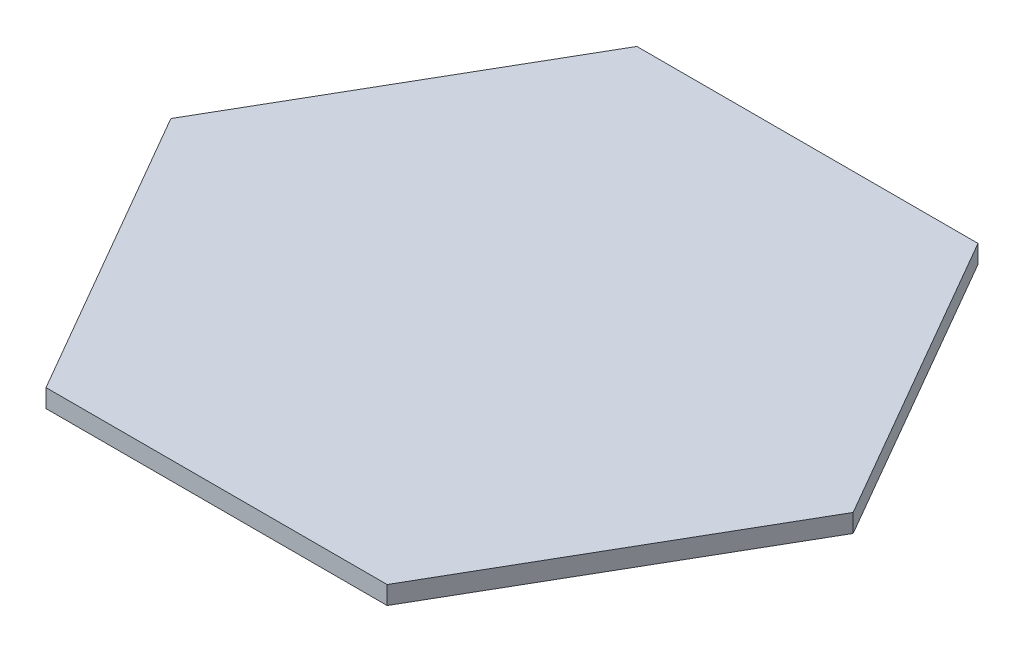
ISO-10303-21;
HEADER;
FILE_DESCRIPTION(('STEP AP214'),'2;1');
FILE_NAME('part.step','',(''),(''),'','','');
FILE_SCHEMA(('AUTOMOTIVE_DESIGN { 1 0 10303 214 1 1 1 1 }'));
ENDSEC;
DATA;
#1=APPLICATION_CONTEXT('core data for automotive mechanical design processes');
#2=APPLICATION_PROTOCOL_DEFINITION('international standard','automotive_design',2000,#1);
#3=PRODUCT_CONTEXT('',#1,'mechanical');
#4=PRODUCT('Part','Part','',(#3));
#5=PRODUCT_RELATED_PRODUCT_CATEGORY('part','',(#4));
#6=PRODUCT_DEFINITION_FORMATION('','',#4);
#7=PRODUCT_DEFINITION_CONTEXT('part definition',#1,'design');
#8=PRODUCT_DEFINITION('design','',#6,#7);
#9=PRODUCT_DEFINITION_SHAPE('','',#8);
#10=(LENGTH_UNIT() NAMED_UNIT(*) SI_UNIT(.MILLI.,.METRE.));
#11=(NAMED_UNIT(*) PLANE_ANGLE_UNIT() SI_UNIT($,.RADIAN.));
#12=(NAMED_UNIT(*) SI_UNIT($,.STERADIAN.) SOLID_ANGLE_UNIT());
#13=UNCERTAINTY_MEASURE_WITH_UNIT(LENGTH_MEASURE(1.E-05),#10,'distance_accuracy_value','');
#14=(GEOMETRIC_REPRESENTATION_CONTEXT(3) GLOBAL_UNCERTAINTY_ASSIGNED_CONTEXT((#13)) GLOBAL_UNIT_ASSIGNED_CONTEXT((#10,
#11,#12)) REPRESENTATION_CONTEXT('',''));
#15=CARTESIAN_POINT('',(0.,0.,0.));
#16=DIRECTION('',(0.,0.,1.));
#17=DIRECTION('',(1.,0.,0.));
#18=AXIS2_PLACEMENT_3D('',#15,#16,#17);
#19=CARTESIAN_POINT('',(29.7198384506252,3.175,51.4762701892219));
#20=DIRECTION('',(-0.866025403784439,0.,-0.499999999999999));
#21=DIRECTION('',(-0.5,0.,0.866025403784439));
#22=AXIS2_PLACEMENT_3D('',#19,#20,#21);
#23=PLANE('',#22);
#24=DIRECTION('',(0.499999999999999,0.,-0.866025403784439));
#25=VECTOR('',#24,1.);
#26=CARTESIAN_POINT('',(29.7198384506252,0.,51.4762701892219));
#27=LINE('',#26,#25);
#28=CARTESIAN_POINT('',(29.7198384506252,0.,51.4762701892219));
#29=VERTEX_POINT('',#28);
#30=CARTESIAN_POINT('',(59.4396769012504,0.,0.));
#31=VERTEX_POINT('',#30);
#32=EDGE_CURVE('E116',#29,#31,#27,.T.);
#33=ORIENTED_EDGE('',*,*,#32,.T.);
#34=DIRECTION('',(0.,-1.,0.));
#35=VECTOR('',#34,1.);
#36=CARTESIAN_POINT('',(59.4396769012504,3.175,0.));
#37=LINE('',#36,#35);
#38=CARTESIAN_POINT('',(59.4396769012504,3.175,0.));
#39=VERTEX_POINT('',#38);
#40=EDGE_CURVE('E11',#39,#31,#37,.T.);
#41=ORIENTED_EDGE('',*,*,#40,.F.);
#42=DIRECTION('',(0.499999999999999,0.,-0.866025403784439));
#43=VECTOR('',#42,1.);
#44=CARTESIAN_POINT('',(29.7198384506252,3.175,51.4762701892219));
#45=LINE('',#44,#43);
#46=CARTESIAN_POINT('',(29.7198384506252,3.175,51.4762701892219));
#47=VERTEX_POINT('',#46);
#48=EDGE_CURVE('E126',#47,#39,#45,.T.);
#49=ORIENTED_EDGE('',*,*,#48,.F.);
#50=DIRECTION('',(0.,-1.,0.));
#51=VECTOR('',#50,1.);
#52=CARTESIAN_POINT('',(29.7198384506252,3.175,51.4762701892219));
#53=LINE('',#52,#51);
#54=EDGE_CURVE('E112',#47,#29,#53,.T.);
#55=ORIENTED_EDGE('',*,*,#54,.T.);
#56=EDGE_LOOP('',(#33,#41,#49,#55));
#57=FACE_BOUND('',#56,.T.);
#58=ADVANCED_FACE('F32',(#57),#23,.F.);
#59=CARTESIAN_POINT('',(59.4396769012504,3.175,0.));
#60=DIRECTION('',(-0.866025403784438,0.,0.5));
#61=DIRECTION('',(0.5,0.,0.866025403784438));
#62=AXIS2_PLACEMENT_3D('',#59,#60,#61);
#63=PLANE('',#62);
#64=DIRECTION('',(-0.5,0.,-0.866025403784438));
#65=VECTOR('',#64,1.);
#66=CARTESIAN_POINT('',(59.4396769012504,0.,0.));
#67=LINE('',#66,#65);
#68=CARTESIAN_POINT('',(29.7198384506252,0.,-51.4762701892219));
#69=VERTEX_POINT('',#68);
#70=EDGE_CURVE('E119',#31,#69,#67,.T.);
#71=ORIENTED_EDGE('',*,*,#70,.T.);
#72=DIRECTION('',(0.,-1.,0.));
#73=VECTOR('',#72,1.);
#74=CARTESIAN_POINT('',(29.7198384506252,3.175,-51.4762701892219));
#75=LINE('',#74,#73);
#76=CARTESIAN_POINT('',(29.7198384506252,3.175,-51.4762701892219));
#77=VERTEX_POINT('',#76);
#78=EDGE_CURVE('E40',#77,#69,#75,.T.);
#79=ORIENTED_EDGE('',*,*,#78,.F.);
#80=DIRECTION('',(-0.5,0.,-0.866025403784438));
#81=VECTOR('',#80,1.);
#82=CARTESIAN_POINT('',(59.4396769012504,3.175,0.));
#83=LINE('',#82,#81);
#84=EDGE_CURVE('E85',#39,#77,#83,.T.);
#85=ORIENTED_EDGE('',*,*,#84,.F.);
#86=ORIENTED_EDGE('',*,*,#40,.T.);
#87=EDGE_LOOP('',(#71,#79,#85,#86));
#88=FACE_BOUND('',#87,.T.);
#89=ADVANCED_FACE('F150',(#88),#63,.F.);
#90=CARTESIAN_POINT('',(29.7198384506252,3.175,-51.4762701892219));
#91=DIRECTION('',(0.,0.,1.));
#92=DIRECTION('',(1.,0.,0.));
#93=AXIS2_PLACEMENT_3D('',#90,#91,#92);
#94=PLANE('',#93);
#95=DIRECTION('',(-1.,0.,0.));
#96=VECTOR('',#95,1.);
#97=CARTESIAN_POINT('',(29.7198384506252,0.,-51.4762701892219));
#98=LINE('',#97,#96);
#99=CARTESIAN_POINT('',(-29.7198384506252,0.,-51.4762701892219));
#100=VERTEX_POINT('',#99);
#101=EDGE_CURVE('E121',#69,#100,#98,.T.);
#102=ORIENTED_EDGE('',*,*,#101,.T.);
#103=DIRECTION('',(0.,-1.,0.));
#104=VECTOR('',#103,1.);
#105=CARTESIAN_POINT('',(-29.7198384506252,3.175,-51.4762701892219));
#106=LINE('',#105,#104);
#107=CARTESIAN_POINT('',(-29.7198384506252,3.175,-51.4762701892219));
#108=VERTEX_POINT('',#107);
#109=EDGE_CURVE('E107',#108,#100,#106,.T.);
#110=ORIENTED_EDGE('',*,*,#109,.F.);
#111=DIRECTION('',(-1.,0.,0.));
#112=VECTOR('',#111,1.);
#113=CARTESIAN_POINT('',(29.7198384506252,3.175,-51.4762701892219));
#114=LINE('',#113,#112);
#115=EDGE_CURVE('E98',#77,#108,#114,.T.);
#116=ORIENTED_EDGE('',*,*,#115,.F.);
#117=ORIENTED_EDGE('',*,*,#78,.T.);
#118=EDGE_LOOP('',(#102,#110,#116,#117));
#119=FACE_BOUND('',#118,.T.);
#120=ADVANCED_FACE('F132',(#119),#94,.F.);
#121=CARTESIAN_POINT('',(-29.7198384506252,3.175,-51.4762701892219));
#122=DIRECTION('',(0.866025403784439,0.,0.5));
#123=DIRECTION('',(0.5,0.,-0.866025403784439));
#124=AXIS2_PLACEMENT_3D('',#121,#122,#123);
#125=PLANE('',#124);
#126=DIRECTION('',(-0.5,0.,0.866025403784439));
#127=VECTOR('',#126,1.);
#128=CARTESIAN_POINT('',(-29.7198384506252,0.,-51.4762701892219));
#129=LINE('',#128,#127);
#130=CARTESIAN_POINT('',(-59.4396769012504,0.,0.));
#131=VERTEX_POINT('',#130);
#132=EDGE_CURVE('E106',#100,#131,#129,.T.);
#133=ORIENTED_EDGE('',*,*,#132,.T.);
#134=DIRECTION('',(0.,-1.,0.));
#135=VECTOR('',#134,1.);
#136=CARTESIAN_POINT('',(-59.4396769012504,3.175,0.));
#137=LINE('',#136,#135);
#138=CARTESIAN_POINT('',(-59.4396769012504,3.175,0.));
#139=VERTEX_POINT('',#138);
#140=EDGE_CURVE('E103',#139,#131,#137,.T.);
#141=ORIENTED_EDGE('',*,*,#140,.F.);
#142=DIRECTION('',(-0.5,0.,0.866025403784439));
#143=VECTOR('',#142,1.);
#144=CARTESIAN_POINT('',(-29.7198384506252,3.175,-51.4762701892219));
#145=LINE('',#144,#143);
#146=EDGE_CURVE('E92',#108,#139,#145,.T.);
#147=ORIENTED_EDGE('',*,*,#146,.F.);
#148=ORIENTED_EDGE('',*,*,#109,.T.);
#149=EDGE_LOOP('',(#133,#141,#147,#148));
#150=FACE_BOUND('',#149,.T.);
#151=ADVANCED_FACE('F104',(#150),#125,.F.);
#152=CARTESIAN_POINT('',(-59.4396769012504,3.175,0.));
#153=DIRECTION('',(0.866025403784439,0.,-0.5));
#154=DIRECTION('',(-0.5,0.,-0.866025403784439));
#155=AXIS2_PLACEMENT_3D('',#152,#153,#154);
#156=PLANE('',#155);
#157=DIRECTION('',(0.5,0.,0.866025403784439));
#158=VECTOR('',#157,1.);
#159=CARTESIAN_POINT('',(-59.4396769012504,0.,0.));
#160=LINE('',#159,#158);
#161=CARTESIAN_POINT('',(-29.7198384506252,0.,51.4762701892219));
#162=VERTEX_POINT('',#161);
#163=EDGE_CURVE('E71',#131,#162,#160,.T.);
#164=ORIENTED_EDGE('',*,*,#163,.T.);
#165=DIRECTION('',(0.,-1.,0.));
#166=VECTOR('',#165,1.);
#167=CARTESIAN_POINT('',(-29.7198384506252,3.175,51.4762701892219));
#168=LINE('',#167,#166);
#169=CARTESIAN_POINT('',(-29.7198384506252,3.175,51.4762701892219));
#170=VERTEX_POINT('',#169);
#171=EDGE_CURVE('E108',#170,#162,#168,.T.);
#172=ORIENTED_EDGE('',*,*,#171,.F.);
#173=DIRECTION('',(0.5,0.,0.866025403784439));
#174=VECTOR('',#173,1.);
#175=CARTESIAN_POINT('',(-59.4396769012504,3.175,0.));
#176=LINE('',#175,#174);
#177=EDGE_CURVE('E96',#139,#170,#176,.T.);
#178=ORIENTED_EDGE('',*,*,#177,.F.);
#179=ORIENTED_EDGE('',*,*,#140,.T.);
#180=EDGE_LOOP('',(#164,#172,#178,#179));
#181=FACE_BOUND('',#180,.T.);
#182=ADVANCED_FACE('F110',(#181),#156,.F.);
#183=CARTESIAN_POINT('',(-29.7198384506252,3.175,51.4762701892219));
#184=DIRECTION('',(0.,0.,-1.));
#185=DIRECTION('',(-1.,0.,0.));
#186=AXIS2_PLACEMENT_3D('',#183,#184,#185);
#187=PLANE('',#186);
#188=DIRECTION('',(1.,0.,0.));
#189=VECTOR('',#188,1.);
#190=CARTESIAN_POINT('',(-29.7198384506252,0.,51.4762701892219));
#191=LINE('',#190,#189);
#192=EDGE_CURVE('E77',#162,#29,#191,.T.);
#193=ORIENTED_EDGE('',*,*,#192,.T.);
#194=ORIENTED_EDGE('',*,*,#54,.F.);
#195=DIRECTION('',(1.,0.,0.));
#196=VECTOR('',#195,1.);
#197=CARTESIAN_POINT('',(-29.7198384506252,3.175,51.4762701892219));
#198=LINE('',#197,#196);
#199=EDGE_CURVE('E48',#170,#47,#198,.T.);
#200=ORIENTED_EDGE('',*,*,#199,.F.);
#201=ORIENTED_EDGE('',*,*,#171,.T.);
#202=EDGE_LOOP('',(#193,#194,#200,#201));
#203=FACE_BOUND('',#202,.T.);
#204=ADVANCED_FACE('F139',(#203),#187,.F.);
#205=CARTESIAN_POINT('',(0.,3.175,0.));
#206=DIRECTION('',(0.,1.,0.));
#207=DIRECTION('',(0.,0.,1.));
#208=AXIS2_PLACEMENT_3D('',#205,#206,#207);
#209=PLANE('',#208);
#210=ORIENTED_EDGE('',*,*,#48,.T.);
#211=ORIENTED_EDGE('',*,*,#84,.T.);
#212=ORIENTED_EDGE('',*,*,#115,.T.);
#213=ORIENTED_EDGE('',*,*,#146,.T.);
#214=ORIENTED_EDGE('',*,*,#177,.T.);
#215=ORIENTED_EDGE('',*,*,#199,.T.);
#216=EDGE_LOOP('',(#210,#211,#212,#213,#214,#215));
#217=FACE_BOUND('',#216,.T.);
#218=ADVANCED_FACE('F94',(#217),#209,.T.);
#219=CARTESIAN_POINT('',(0.,0.,0.));
#220=DIRECTION('',(0.,1.,0.));
#221=DIRECTION('',(0.,0.,1.));
#222=AXIS2_PLACEMENT_3D('',#219,#220,#221);
#223=PLANE('',#222);
#224=ORIENTED_EDGE('',*,*,#32,.F.);
#225=ORIENTED_EDGE('',*,*,#192,.F.);
#226=ORIENTED_EDGE('',*,*,#163,.F.);
#227=ORIENTED_EDGE('',*,*,#132,.F.);
#228=ORIENTED_EDGE('',*,*,#101,.F.);
#229=ORIENTED_EDGE('',*,*,#70,.F.);
#230=EDGE_LOOP('',(#224,#225,#226,#227,#228,#229));
#231=FACE_BOUND('',#230,.T.);
#232=ADVANCED_FACE('F135',(#231),#223,.F.);
#233=CLOSED_SHELL('',(#58,#89,#120,#151,#182,#204,#218,#232));
#234=MANIFOLD_SOLID_BREP('B2',#233);
#235=ADVANCED_BREP_SHAPE_REPRESENTATION('',(#18,#234),#14);
#236=SHAPE_DEFINITION_REPRESENTATION(#9,#235);
ENDSEC;
END-ISO-10303-21;
